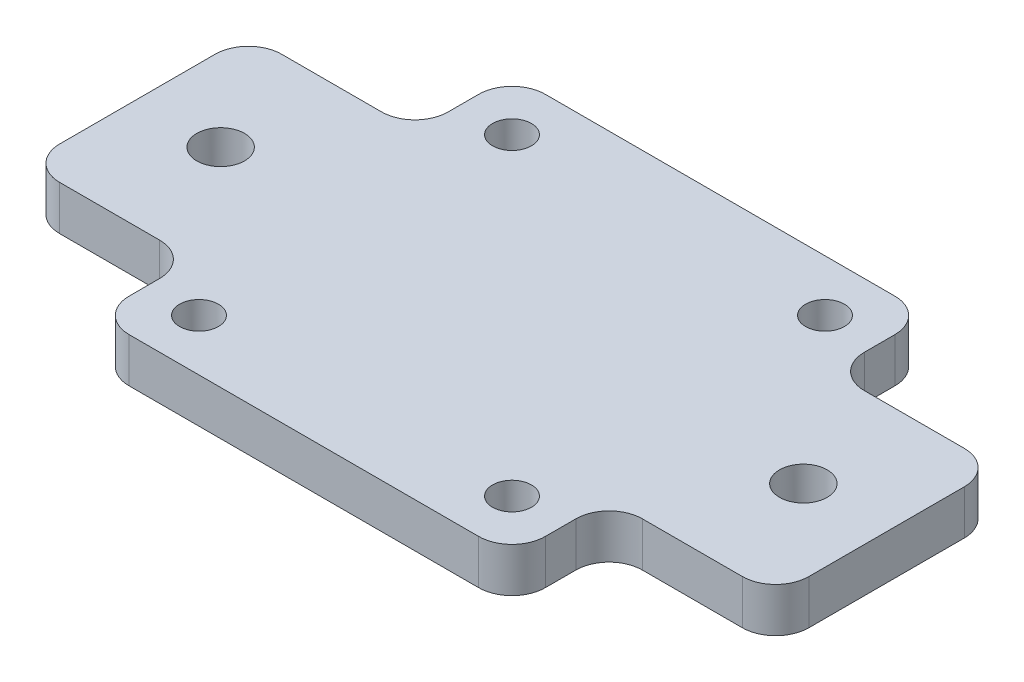
ISO-10303-21;
HEADER;
FILE_DESCRIPTION(('STEP AP214'),'2;1');
FILE_NAME('part.step','',(''),(''),'','','');
FILE_SCHEMA(('AUTOMOTIVE_DESIGN { 1 0 10303 214 1 1 1 1 }'));
ENDSEC;
DATA;
#1=APPLICATION_CONTEXT('core data for automotive mechanical design processes');
#2=APPLICATION_PROTOCOL_DEFINITION('international standard','automotive_design',2000,#1);
#3=PRODUCT_CONTEXT('',#1,'mechanical');
#4=PRODUCT('Part','Part','',(#3));
#5=PRODUCT_RELATED_PRODUCT_CATEGORY('part','',(#4));
#6=PRODUCT_DEFINITION_FORMATION('','',#4);
#7=PRODUCT_DEFINITION_CONTEXT('part definition',#1,'design');
#8=PRODUCT_DEFINITION('design','',#6,#7);
#9=PRODUCT_DEFINITION_SHAPE('','',#8);
#10=(LENGTH_UNIT() NAMED_UNIT(*) SI_UNIT(.MILLI.,.METRE.));
#11=(NAMED_UNIT(*) PLANE_ANGLE_UNIT() SI_UNIT($,.RADIAN.));
#12=(NAMED_UNIT(*) SI_UNIT($,.STERADIAN.) SOLID_ANGLE_UNIT());
#13=UNCERTAINTY_MEASURE_WITH_UNIT(LENGTH_MEASURE(1.E-05),#10,'distance_accuracy_value','');
#14=(GEOMETRIC_REPRESENTATION_CONTEXT(3) GLOBAL_UNCERTAINTY_ASSIGNED_CONTEXT((#13)) GLOBAL_UNIT_ASSIGNED_CONTEXT((#10,
#11,#12)) REPRESENTATION_CONTEXT('',''));
#15=CARTESIAN_POINT('',(0.,0.,0.));
#16=DIRECTION('',(0.,0.,1.));
#17=DIRECTION('',(1.,0.,0.));
#18=AXIS2_PLACEMENT_3D('',#15,#16,#17);
#19=CARTESIAN_POINT('',(18.75,4.,18.75));
#20=DIRECTION('',(-1.,0.,0.));
#21=DIRECTION('',(0.,0.,1.));
#22=AXIS2_PLACEMENT_3D('',#19,#20,#21);
#23=PLANE('',#22);
#24=DIRECTION('',(0.,0.,-1.));
#25=VECTOR('',#24,1.);
#26=CARTESIAN_POINT('',(18.75,0.,18.75));
#27=LINE('',#26,#25);
#28=CARTESIAN_POINT('',(18.75,0.,15.75));
#29=VERTEX_POINT('',#28);
#30=CARTESIAN_POINT('',(18.75,0.,13.));
#31=VERTEX_POINT('',#30);
#32=EDGE_CURVE('E335',#29,#31,#27,.T.);
#33=ORIENTED_EDGE('',*,*,#32,.T.);
#34=DIRECTION('',(0.,-1.,0.));
#35=VECTOR('',#34,1.);
#36=CARTESIAN_POINT('',(18.75,4.,13.));
#37=LINE('',#36,#35);
#38=CARTESIAN_POINT('',(18.75,4.,13.));
#39=VERTEX_POINT('',#38);
#40=EDGE_CURVE('E321',#31,#39,#37,.F.);
#41=ORIENTED_EDGE('',*,*,#40,.T.);
#42=DIRECTION('',(0.,0.,-1.));
#43=VECTOR('',#42,1.);
#44=CARTESIAN_POINT('',(18.75,4.,18.75));
#45=LINE('',#44,#43);
#46=CARTESIAN_POINT('',(18.75,4.,15.75));
#47=VERTEX_POINT('',#46);
#48=EDGE_CURVE('E354',#47,#39,#45,.T.);
#49=ORIENTED_EDGE('',*,*,#48,.F.);
#50=DIRECTION('',(0.,-1.,0.));
#51=VECTOR('',#50,1.);
#52=CARTESIAN_POINT('',(18.75,4.,15.75));
#53=LINE('',#52,#51);
#54=EDGE_CURVE('E263',#47,#29,#53,.T.);
#55=ORIENTED_EDGE('',*,*,#54,.T.);
#56=EDGE_LOOP('',(#33,#41,#49,#55));
#57=FACE_BOUND('',#56,.T.);
#58=ADVANCED_FACE('F35',(#57),#23,.F.);
#59=CARTESIAN_POINT('',(-18.75,4.,18.75));
#60=DIRECTION('',(1.,0.,0.));
#61=DIRECTION('',(0.,0.,-1.));
#62=AXIS2_PLACEMENT_3D('',#59,#60,#61);
#63=PLANE('',#62);
#64=DIRECTION('',(0.,0.,1.));
#65=VECTOR('',#64,1.);
#66=CARTESIAN_POINT('',(-18.75,4.,18.75));
#67=LINE('',#66,#65);
#68=CARTESIAN_POINT('',(-18.75,4.,13.));
#69=VERTEX_POINT('',#68);
#70=CARTESIAN_POINT('',(-18.75,4.,15.75));
#71=VERTEX_POINT('',#70);
#72=EDGE_CURVE('E409',#69,#71,#67,.T.);
#73=ORIENTED_EDGE('',*,*,#72,.F.);
#74=DIRECTION('',(0.,1.,0.));
#75=VECTOR('',#74,1.);
#76=CARTESIAN_POINT('',(-18.75,0.,13.));
#77=LINE('',#76,#75);
#78=CARTESIAN_POINT('',(-18.75,0.,13.));
#79=VERTEX_POINT('',#78);
#80=EDGE_CURVE('E296',#69,#79,#77,.F.);
#81=ORIENTED_EDGE('',*,*,#80,.T.);
#82=DIRECTION('',(0.,0.,1.));
#83=VECTOR('',#82,1.);
#84=CARTESIAN_POINT('',(-18.75,0.,18.75));
#85=LINE('',#84,#83);
#86=CARTESIAN_POINT('',(-18.75,0.,15.75));
#87=VERTEX_POINT('',#86);
#88=EDGE_CURVE('E229',#79,#87,#85,.T.);
#89=ORIENTED_EDGE('',*,*,#88,.T.);
#90=DIRECTION('',(0.,-1.,0.));
#91=VECTOR('',#90,1.);
#92=CARTESIAN_POINT('',(-18.75,4.,15.75));
#93=LINE('',#92,#91);
#94=EDGE_CURVE('E220',#87,#71,#93,.F.);
#95=ORIENTED_EDGE('',*,*,#94,.T.);
#96=EDGE_LOOP('',(#73,#81,#89,#95));
#97=FACE_BOUND('',#96,.T.);
#98=ADVANCED_FACE('F485',(#97),#63,.F.);
#99=CARTESIAN_POINT('',(18.75,4.,-13.));
#100=VERTEX_POINT('',#99);
#101=CARTESIAN_POINT('',(18.75,4.,-15.75));
#102=VERTEX_POINT('',#101);
#103=EDGE_CURVE('E232',#100,#102,#45,.T.);
#104=ORIENTED_EDGE('',*,*,#103,.F.);
#105=DIRECTION('',(0.,-1.,0.));
#106=VECTOR('',#105,1.);
#107=CARTESIAN_POINT('',(18.75,4.,-13.));
#108=LINE('',#107,#106);
#109=CARTESIAN_POINT('',(18.75,0.,-13.));
#110=VERTEX_POINT('',#109);
#111=EDGE_CURVE('E304',#100,#110,#108,.T.);
#112=ORIENTED_EDGE('',*,*,#111,.T.);
#113=CARTESIAN_POINT('',(18.75,0.,-15.75));
#114=VERTEX_POINT('',#113);
#115=EDGE_CURVE('E345',#110,#114,#27,.T.);
#116=ORIENTED_EDGE('',*,*,#115,.T.);
#117=DIRECTION('',(0.,-1.,0.));
#118=VECTOR('',#117,1.);
#119=CARTESIAN_POINT('',(18.75,4.,-15.75));
#120=LINE('',#119,#118);
#121=EDGE_CURVE('E266',#114,#102,#120,.F.);
#122=ORIENTED_EDGE('',*,*,#121,.T.);
#123=EDGE_LOOP('',(#104,#112,#116,#122));
#124=FACE_BOUND('',#123,.T.);
#125=ADVANCED_FACE('F469',(#124),#23,.F.);
#126=CARTESIAN_POINT('',(-18.75,4.,-18.75));
#127=DIRECTION('',(0.,0.,1.));
#128=DIRECTION('',(1.,0.,0.));
#129=AXIS2_PLACEMENT_3D('',#126,#127,#128);
#130=PLANE('',#129);
#131=DIRECTION('',(-1.,0.,0.));
#132=VECTOR('',#131,1.);
#133=CARTESIAN_POINT('',(-18.75,0.,-18.75));
#134=LINE('',#133,#132);
#135=CARTESIAN_POINT('',(15.75,0.,-18.75));
#136=VERTEX_POINT('',#135);
#137=CARTESIAN_POINT('',(-15.75,0.,-18.75));
#138=VERTEX_POINT('',#137);
#139=EDGE_CURVE('E234',#136,#138,#134,.T.);
#140=ORIENTED_EDGE('',*,*,#139,.T.);
#141=DIRECTION('',(0.,-1.,0.));
#142=VECTOR('',#141,1.);
#143=CARTESIAN_POINT('',(-15.75,4.,-18.75));
#144=LINE('',#143,#142);
#145=CARTESIAN_POINT('',(-15.75,4.,-18.75));
#146=VERTEX_POINT('',#145);
#147=EDGE_CURVE('E202',#138,#146,#144,.F.);
#148=ORIENTED_EDGE('',*,*,#147,.T.);
#149=DIRECTION('',(-1.,0.,0.));
#150=VECTOR('',#149,1.);
#151=CARTESIAN_POINT('',(-18.75,4.,-18.75));
#152=LINE('',#151,#150);
#153=CARTESIAN_POINT('',(15.75,4.,-18.75));
#154=VERTEX_POINT('',#153);
#155=EDGE_CURVE('E406',#154,#146,#152,.T.);
#156=ORIENTED_EDGE('',*,*,#155,.F.);
#157=DIRECTION('',(0.,-1.,0.));
#158=VECTOR('',#157,1.);
#159=CARTESIAN_POINT('',(15.75,4.,-18.75));
#160=LINE('',#159,#158);
#161=EDGE_CURVE('E207',#154,#136,#160,.T.);
#162=ORIENTED_EDGE('',*,*,#161,.T.);
#163=EDGE_LOOP('',(#140,#148,#156,#162));
#164=FACE_BOUND('',#163,.T.);
#165=ADVANCED_FACE('F462',(#164),#130,.F.);
#166=CARTESIAN_POINT('',(-18.75,0.,-15.75));
#167=VERTEX_POINT('',#166);
#168=CARTESIAN_POINT('',(-18.75,0.,-13.));
#169=VERTEX_POINT('',#168);
#170=EDGE_CURVE('E215',#167,#169,#85,.T.);
#171=ORIENTED_EDGE('',*,*,#170,.T.);
#172=DIRECTION('',(0.,1.,0.));
#173=VECTOR('',#172,1.);
#174=CARTESIAN_POINT('',(-18.75,4.,-13.));
#175=LINE('',#174,#173);
#176=CARTESIAN_POINT('',(-18.75,4.,-13.));
#177=VERTEX_POINT('',#176);
#178=EDGE_CURVE('E298',#169,#177,#175,.T.);
#179=ORIENTED_EDGE('',*,*,#178,.T.);
#180=CARTESIAN_POINT('',(-18.75,4.,-15.75));
#181=VERTEX_POINT('',#180);
#182=EDGE_CURVE('E218',#181,#177,#67,.T.);
#183=ORIENTED_EDGE('',*,*,#182,.F.);
#184=DIRECTION('',(0.,-1.,0.));
#185=VECTOR('',#184,1.);
#186=CARTESIAN_POINT('',(-18.75,4.,-15.75));
#187=LINE('',#186,#185);
#188=EDGE_CURVE('E201',#181,#167,#187,.T.);
#189=ORIENTED_EDGE('',*,*,#188,.T.);
#190=EDGE_LOOP('',(#171,#179,#183,#189));
#191=FACE_BOUND('',#190,.T.);
#192=ADVANCED_FACE('F213',(#191),#63,.F.);
#193=CARTESIAN_POINT('',(-18.75,4.,18.75));
#194=DIRECTION('',(0.,0.,-1.));
#195=DIRECTION('',(-1.,0.,0.));
#196=AXIS2_PLACEMENT_3D('',#193,#194,#195);
#197=PLANE('',#196);
#198=DIRECTION('',(1.,0.,0.));
#199=VECTOR('',#198,1.);
#200=CARTESIAN_POINT('',(-18.75,4.,18.75));
#201=LINE('',#200,#199);
#202=CARTESIAN_POINT('',(-15.75,4.,18.75));
#203=VERTEX_POINT('',#202);
#204=CARTESIAN_POINT('',(15.75,4.,18.75));
#205=VERTEX_POINT('',#204);
#206=EDGE_CURVE('E239',#203,#205,#201,.T.);
#207=ORIENTED_EDGE('',*,*,#206,.F.);
#208=DIRECTION('',(0.,-1.,0.));
#209=VECTOR('',#208,1.);
#210=CARTESIAN_POINT('',(-15.75,4.,18.75));
#211=LINE('',#210,#209);
#212=CARTESIAN_POINT('',(-15.75,0.,18.75));
#213=VERTEX_POINT('',#212);
#214=EDGE_CURVE('E260',#203,#213,#211,.T.);
#215=ORIENTED_EDGE('',*,*,#214,.T.);
#216=DIRECTION('',(1.,0.,0.));
#217=VECTOR('',#216,1.);
#218=CARTESIAN_POINT('',(-18.75,0.,18.75));
#219=LINE('',#218,#217);
#220=CARTESIAN_POINT('',(15.75,0.,18.75));
#221=VERTEX_POINT('',#220);
#222=EDGE_CURVE('E228',#213,#221,#219,.T.);
#223=ORIENTED_EDGE('',*,*,#222,.T.);
#224=DIRECTION('',(0.,-1.,0.));
#225=VECTOR('',#224,1.);
#226=CARTESIAN_POINT('',(15.75,4.,18.75));
#227=LINE('',#226,#225);
#228=EDGE_CURVE('E258',#221,#205,#227,.F.);
#229=ORIENTED_EDGE('',*,*,#228,.T.);
#230=EDGE_LOOP('',(#207,#215,#223,#229));
#231=FACE_BOUND('',#230,.T.);
#232=ADVANCED_FACE('F421',(#231),#197,.F.);
#233=CARTESIAN_POINT('',(0.,4.,0.));
#234=DIRECTION('',(0.,-1.,0.));
#235=DIRECTION('',(0.,0.,-1.));
#236=AXIS2_PLACEMENT_3D('',#233,#234,#235);
#237=PLANE('',#236);
#238=CARTESIAN_POINT('',(-26.25,4.,0.));
#239=DIRECTION('',(0.,-1.,0.));
#240=DIRECTION('',(0.,0.,-1.));
#241=AXIS2_PLACEMENT_3D('',#238,#239,#240);
#242=CIRCLE('',#241,2.15);
#243=CARTESIAN_POINT('',(-26.25,4.,-2.15));
#244=VERTEX_POINT('',#243);
#245=EDGE_CURVE('E371',#244,#244,#242,.T.);
#246=ORIENTED_EDGE('',*,*,#245,.T.);
#247=EDGE_LOOP('',(#246));
#248=FACE_BOUND('',#247,.T.);
#249=CARTESIAN_POINT('',(26.25,4.,0.));
#250=DIRECTION('',(0.,-1.,0.));
#251=DIRECTION('',(0.,0.,-1.));
#252=AXIS2_PLACEMENT_3D('',#249,#250,#251);
#253=CIRCLE('',#252,2.15);
#254=CARTESIAN_POINT('',(26.25,4.,-2.15000000000001));
#255=VERTEX_POINT('',#254);
#256=EDGE_CURVE('E552',#255,#255,#253,.T.);
#257=ORIENTED_EDGE('',*,*,#256,.T.);
#258=EDGE_LOOP('',(#257));
#259=FACE_BOUND('',#258,.T.);
#260=CARTESIAN_POINT('',(14.1,4.,-14.1));
#261=DIRECTION('',(0.,-1.,0.));
#262=DIRECTION('',(0.,0.,-1.));
#263=AXIS2_PLACEMENT_3D('',#260,#261,#262);
#264=CIRCLE('',#263,1.75);
#265=CARTESIAN_POINT('',(14.1,4.,-15.85));
#266=VERTEX_POINT('',#265);
#267=EDGE_CURVE('E396',#266,#266,#264,.T.);
#268=ORIENTED_EDGE('',*,*,#267,.T.);
#269=EDGE_LOOP('',(#268));
#270=FACE_BOUND('',#269,.T.);
#271=CARTESIAN_POINT('',(-14.1,4.,-14.1));
#272=DIRECTION('',(0.,-1.,0.));
#273=DIRECTION('',(0.,0.,-1.));
#274=AXIS2_PLACEMENT_3D('',#271,#272,#273);
#275=CIRCLE('',#274,1.75);
#276=CARTESIAN_POINT('',(-14.1,4.,-15.85));
#277=VERTEX_POINT('',#276);
#278=EDGE_CURVE('E393',#277,#277,#275,.T.);
#279=ORIENTED_EDGE('',*,*,#278,.T.);
#280=EDGE_LOOP('',(#279));
#281=FACE_BOUND('',#280,.T.);
#282=DIRECTION('',(0.,0.,-1.));
#283=VECTOR('',#282,1.);
#284=CARTESIAN_POINT('',(-33.75,4.,-10.));
#285=LINE('',#284,#283);
#286=CARTESIAN_POINT('',(-33.75,4.,7.));
#287=VERTEX_POINT('',#286);
#288=CARTESIAN_POINT('',(-33.75,4.,-7.));
#289=VERTEX_POINT('',#288);
#290=EDGE_CURVE('E381',#287,#289,#285,.T.);
#291=ORIENTED_EDGE('',*,*,#290,.F.);
#292=CARTESIAN_POINT('',(-30.75,4.,7.));
#293=DIRECTION('',(0.,-1.,0.));
#294=DIRECTION('',(0.,0.,-1.));
#295=AXIS2_PLACEMENT_3D('',#292,#293,#294);
#296=CIRCLE('',#295,3.);
#297=CARTESIAN_POINT('',(-30.75,4.,10.));
#298=VERTEX_POINT('',#297);
#299=EDGE_CURVE('E294',#287,#298,#296,.F.);
#300=ORIENTED_EDGE('',*,*,#299,.T.);
#301=DIRECTION('',(-1.,0.,0.));
#302=VECTOR('',#301,1.);
#303=CARTESIAN_POINT('',(-33.75,4.,10.));
#304=LINE('',#303,#302);
#305=CARTESIAN_POINT('',(-21.75,4.,10.));
#306=VERTEX_POINT('',#305);
#307=EDGE_CURVE('E359',#306,#298,#304,.T.);
#308=ORIENTED_EDGE('',*,*,#307,.F.);
#309=CARTESIAN_POINT('',(-21.75,4.,13.));
#310=DIRECTION('',(0.,-1.,0.));
#311=DIRECTION('',(0.,0.,-1.));
#312=AXIS2_PLACEMENT_3D('',#309,#310,#311);
#313=CIRCLE('',#312,3.);
#314=EDGE_CURVE('E323',#306,#69,#313,.T.);
#315=ORIENTED_EDGE('',*,*,#314,.T.);
#316=ORIENTED_EDGE('',*,*,#72,.T.);
#317=CARTESIAN_POINT('',(-15.75,4.,15.75));
#318=DIRECTION('',(0.,-1.,0.));
#319=DIRECTION('',(0.,0.,-1.));
#320=AXIS2_PLACEMENT_3D('',#317,#318,#319);
#321=CIRCLE('',#320,3.);
#322=EDGE_CURVE('E254',#71,#203,#321,.F.);
#323=ORIENTED_EDGE('',*,*,#322,.T.);
#324=ORIENTED_EDGE('',*,*,#206,.T.);
#325=CARTESIAN_POINT('',(15.75,4.,15.75));
#326=DIRECTION('',(0.,-1.,0.));
#327=DIRECTION('',(0.,0.,-1.));
#328=AXIS2_PLACEMENT_3D('',#325,#326,#327);
#329=CIRCLE('',#328,3.);
#330=EDGE_CURVE('E250',#205,#47,#329,.F.);
#331=ORIENTED_EDGE('',*,*,#330,.T.);
#332=ORIENTED_EDGE('',*,*,#48,.T.);
#333=CARTESIAN_POINT('',(21.75,4.,13.));
#334=DIRECTION('',(0.,-1.,0.));
#335=DIRECTION('',(0.,0.,-1.));
#336=AXIS2_PLACEMENT_3D('',#333,#334,#335);
#337=CIRCLE('',#336,3.);
#338=CARTESIAN_POINT('',(21.75,4.,10.));
#339=VERTEX_POINT('',#338);
#340=EDGE_CURVE('E11',#39,#339,#337,.T.);
#341=ORIENTED_EDGE('',*,*,#340,.T.);
#342=CARTESIAN_POINT('',(30.75,4.,10.));
#343=VERTEX_POINT('',#342);
#344=EDGE_CURVE('E352',#343,#339,#304,.T.);
#345=ORIENTED_EDGE('',*,*,#344,.F.);
#346=CARTESIAN_POINT('',(30.75,4.,7.));
#347=DIRECTION('',(0.,-1.,0.));
#348=DIRECTION('',(0.,0.,-1.));
#349=AXIS2_PLACEMENT_3D('',#346,#347,#348);
#350=CIRCLE('',#349,3.);
#351=CARTESIAN_POINT('',(33.75,4.,7.));
#352=VERTEX_POINT('',#351);
#353=EDGE_CURVE('E288',#343,#352,#350,.F.);
#354=ORIENTED_EDGE('',*,*,#353,.T.);
#355=DIRECTION('',(0.,0.,-1.));
#356=VECTOR('',#355,1.);
#357=CARTESIAN_POINT('',(33.75,4.,-10.));
#358=LINE('',#357,#356);
#359=CARTESIAN_POINT('',(33.75,4.,-7.));
#360=VERTEX_POINT('',#359);
#361=EDGE_CURVE('E365',#352,#360,#358,.T.);
#362=ORIENTED_EDGE('',*,*,#361,.T.);
#363=CARTESIAN_POINT('',(30.75,4.,-7.));
#364=DIRECTION('',(0.,-1.,0.));
#365=DIRECTION('',(0.,0.,-1.));
#366=AXIS2_PLACEMENT_3D('',#363,#364,#365);
#367=CIRCLE('',#366,3.);
#368=CARTESIAN_POINT('',(30.75,4.,-10.));
#369=VERTEX_POINT('',#368);
#370=EDGE_CURVE('E290',#360,#369,#367,.F.);
#371=ORIENTED_EDGE('',*,*,#370,.T.);
#372=DIRECTION('',(-1.,0.,0.));
#373=VECTOR('',#372,1.);
#374=CARTESIAN_POINT('',(-33.75,4.,-10.));
#375=LINE('',#374,#373);
#376=CARTESIAN_POINT('',(21.75,4.,-10.));
#377=VERTEX_POINT('',#376);
#378=EDGE_CURVE('E557',#369,#377,#375,.T.);
#379=ORIENTED_EDGE('',*,*,#378,.T.);
#380=CARTESIAN_POINT('',(21.75,4.,-13.));
#381=DIRECTION('',(0.,-1.,0.));
#382=DIRECTION('',(0.,0.,-1.));
#383=AXIS2_PLACEMENT_3D('',#380,#381,#382);
#384=CIRCLE('',#383,3.);
#385=EDGE_CURVE('E50',#377,#100,#384,.T.);
#386=ORIENTED_EDGE('',*,*,#385,.T.);
#387=ORIENTED_EDGE('',*,*,#103,.T.);
#388=CARTESIAN_POINT('',(15.75,4.,-15.75));
#389=DIRECTION('',(0.,-1.,0.));
#390=DIRECTION('',(0.,0.,-1.));
#391=AXIS2_PLACEMENT_3D('',#388,#389,#390);
#392=CIRCLE('',#391,3.);
#393=EDGE_CURVE('E252',#102,#154,#392,.F.);
#394=ORIENTED_EDGE('',*,*,#393,.T.);
#395=ORIENTED_EDGE('',*,*,#155,.T.);
#396=CARTESIAN_POINT('',(-15.75,4.,-15.75));
#397=DIRECTION('',(0.,-1.,0.));
#398=DIRECTION('',(0.,0.,-1.));
#399=AXIS2_PLACEMENT_3D('',#396,#397,#398);
#400=CIRCLE('',#399,3.);
#401=EDGE_CURVE('E256',#146,#181,#400,.F.);
#402=ORIENTED_EDGE('',*,*,#401,.T.);
#403=ORIENTED_EDGE('',*,*,#182,.T.);
#404=CARTESIAN_POINT('',(-21.75,4.,-13.));
#405=DIRECTION('',(0.,-1.,0.));
#406=DIRECTION('',(0.,0.,-1.));
#407=AXIS2_PLACEMENT_3D('',#404,#405,#406);
#408=CIRCLE('',#407,3.);
#409=CARTESIAN_POINT('',(-21.75,4.,-10.));
#410=VERTEX_POINT('',#409);
#411=EDGE_CURVE('E327',#177,#410,#408,.T.);
#412=ORIENTED_EDGE('',*,*,#411,.T.);
#413=CARTESIAN_POINT('',(-30.75,4.,-10.));
#414=VERTEX_POINT('',#413);
#415=EDGE_CURVE('E384',#410,#414,#375,.T.);
#416=ORIENTED_EDGE('',*,*,#415,.T.);
#417=CARTESIAN_POINT('',(-30.75,4.,-7.));
#418=DIRECTION('',(0.,-1.,0.));
#419=DIRECTION('',(0.,0.,-1.));
#420=AXIS2_PLACEMENT_3D('',#417,#418,#419);
#421=CIRCLE('',#420,3.);
#422=EDGE_CURVE('E292',#414,#289,#421,.F.);
#423=ORIENTED_EDGE('',*,*,#422,.T.);
#424=EDGE_LOOP('',(#291,#300,#308,#315,#316,#323,#324,#331,#332,#341,#345,#354,#362,#371,#379,
#386,#387,#394,#395,#402,#403,#412,#416,#423));
#425=FACE_BOUND('',#424,.T.);
#426=CARTESIAN_POINT('',(14.1,4.,14.1));
#427=DIRECTION('',(0.,-1.,0.));
#428=DIRECTION('',(0.,0.,-1.));
#429=AXIS2_PLACEMENT_3D('',#426,#427,#428);
#430=CIRCLE('',#429,1.75);
#431=CARTESIAN_POINT('',(14.1,4.,12.35));
#432=VERTEX_POINT('',#431);
#433=EDGE_CURVE('E399',#432,#432,#430,.T.);
#434=ORIENTED_EDGE('',*,*,#433,.T.);
#435=EDGE_LOOP('',(#434));
#436=FACE_BOUND('',#435,.T.);
#437=CARTESIAN_POINT('',(-14.1,4.,14.1));
#438=DIRECTION('',(0.,-1.,0.));
#439=DIRECTION('',(0.,0.,-1.));
#440=AXIS2_PLACEMENT_3D('',#437,#438,#439);
#441=CIRCLE('',#440,1.75);
#442=CARTESIAN_POINT('',(-14.1,4.,12.35));
#443=VERTEX_POINT('',#442);
#444=EDGE_CURVE('E402',#443,#443,#441,.T.);
#445=ORIENTED_EDGE('',*,*,#444,.T.);
#446=EDGE_LOOP('',(#445));
#447=FACE_BOUND('',#446,.T.);
#448=ADVANCED_FACE('F350',(#248,#259,#270,#281,#425,#436,#447),#237,.F.);
#449=CARTESIAN_POINT('',(0.,0.,0.));
#450=DIRECTION('',(0.,-1.,0.));
#451=DIRECTION('',(0.,0.,-1.));
#452=AXIS2_PLACEMENT_3D('',#449,#450,#451);
#453=PLANE('',#452);
#454=CARTESIAN_POINT('',(-26.25,0.,0.));
#455=DIRECTION('',(0.,1.,0.));
#456=DIRECTION('',(0.,0.,1.));
#457=AXIS2_PLACEMENT_3D('',#454,#455,#456);
#458=CIRCLE('',#457,2.15);
#459=CARTESIAN_POINT('',(-26.25,0.,2.15));
#460=VERTEX_POINT('',#459);
#461=EDGE_CURVE('E549',#460,#460,#458,.T.);
#462=ORIENTED_EDGE('',*,*,#461,.T.);
#463=EDGE_LOOP('',(#462));
#464=FACE_BOUND('',#463,.T.);
#465=CARTESIAN_POINT('',(26.25,0.,0.));
#466=DIRECTION('',(0.,1.,0.));
#467=DIRECTION('',(0.,0.,1.));
#468=AXIS2_PLACEMENT_3D('',#465,#466,#467);
#469=CIRCLE('',#468,2.15);
#470=CARTESIAN_POINT('',(26.25,0.,2.14999999999999));
#471=VERTEX_POINT('',#470);
#472=EDGE_CURVE('E770',#471,#471,#469,.T.);
#473=ORIENTED_EDGE('',*,*,#472,.T.);
#474=EDGE_LOOP('',(#473));
#475=FACE_BOUND('',#474,.T.);
#476=DIRECTION('',(1.,0.,0.));
#477=VECTOR('',#476,1.);
#478=CARTESIAN_POINT('',(-33.75,0.,10.));
#479=LINE('',#478,#477);
#480=CARTESIAN_POINT('',(-30.75,0.,10.));
#481=VERTEX_POINT('',#480);
#482=CARTESIAN_POINT('',(-21.75,0.,10.));
#483=VERTEX_POINT('',#482);
#484=EDGE_CURVE('E370',#481,#483,#479,.T.);
#485=ORIENTED_EDGE('',*,*,#484,.F.);
#486=CARTESIAN_POINT('',(-30.75,0.,7.));
#487=DIRECTION('',(0.,-1.,0.));
#488=DIRECTION('',(0.,0.,-1.));
#489=AXIS2_PLACEMENT_3D('',#486,#487,#488);
#490=CIRCLE('',#489,3.);
#491=CARTESIAN_POINT('',(-33.75,0.,7.));
#492=VERTEX_POINT('',#491);
#493=EDGE_CURVE('E281',#481,#492,#490,.T.);
#494=ORIENTED_EDGE('',*,*,#493,.T.);
#495=DIRECTION('',(0.,0.,1.));
#496=VECTOR('',#495,1.);
#497=CARTESIAN_POINT('',(-33.75,0.,-10.));
#498=LINE('',#497,#496);
#499=CARTESIAN_POINT('',(-33.75,0.,-7.));
#500=VERTEX_POINT('',#499);
#501=EDGE_CURVE('E378',#500,#492,#498,.T.);
#502=ORIENTED_EDGE('',*,*,#501,.F.);
#503=CARTESIAN_POINT('',(-30.75,0.,-7.));
#504=DIRECTION('',(0.,-1.,0.));
#505=DIRECTION('',(0.,0.,-1.));
#506=AXIS2_PLACEMENT_3D('',#503,#504,#505);
#507=CIRCLE('',#506,3.);
#508=CARTESIAN_POINT('',(-30.75,0.,-10.));
#509=VERTEX_POINT('',#508);
#510=EDGE_CURVE('E279',#500,#509,#507,.T.);
#511=ORIENTED_EDGE('',*,*,#510,.T.);
#512=DIRECTION('',(1.,0.,0.));
#513=VECTOR('',#512,1.);
#514=CARTESIAN_POINT('',(-33.75,0.,-10.));
#515=LINE('',#514,#513);
#516=CARTESIAN_POINT('',(-21.75,0.,-10.));
#517=VERTEX_POINT('',#516);
#518=EDGE_CURVE('E376',#509,#517,#515,.T.);
#519=ORIENTED_EDGE('',*,*,#518,.T.);
#520=CARTESIAN_POINT('',(-21.75,0.,-13.));
#521=DIRECTION('',(0.,-1.,0.));
#522=DIRECTION('',(0.,0.,-1.));
#523=AXIS2_PLACEMENT_3D('',#520,#521,#522);
#524=CIRCLE('',#523,3.);
#525=EDGE_CURVE('E227',#517,#169,#524,.F.);
#526=ORIENTED_EDGE('',*,*,#525,.T.);
#527=ORIENTED_EDGE('',*,*,#170,.F.);
#528=CARTESIAN_POINT('',(-15.75,0.,-15.75));
#529=DIRECTION('',(0.,-1.,0.));
#530=DIRECTION('',(0.,0.,-1.));
#531=AXIS2_PLACEMENT_3D('',#528,#529,#530);
#532=CIRCLE('',#531,3.);
#533=EDGE_CURVE('E197',#167,#138,#532,.T.);
#534=ORIENTED_EDGE('',*,*,#533,.T.);
#535=ORIENTED_EDGE('',*,*,#139,.F.);
#536=CARTESIAN_POINT('',(15.75,0.,-15.75));
#537=DIRECTION('',(0.,-1.,0.));
#538=DIRECTION('',(0.,0.,-1.));
#539=AXIS2_PLACEMENT_3D('',#536,#537,#538);
#540=CIRCLE('',#539,3.);
#541=EDGE_CURVE('E242',#136,#114,#540,.T.);
#542=ORIENTED_EDGE('',*,*,#541,.T.);
#543=ORIENTED_EDGE('',*,*,#115,.F.);
#544=CARTESIAN_POINT('',(21.75,0.,-13.));
#545=DIRECTION('',(0.,-1.,0.));
#546=DIRECTION('',(0.,0.,-1.));
#547=AXIS2_PLACEMENT_3D('',#544,#545,#546);
#548=CIRCLE('',#547,3.);
#549=CARTESIAN_POINT('',(21.75,0.,-10.));
#550=VERTEX_POINT('',#549);
#551=EDGE_CURVE('E330',#110,#550,#548,.F.);
#552=ORIENTED_EDGE('',*,*,#551,.T.);
#553=CARTESIAN_POINT('',(30.75,0.,-10.));
#554=VERTEX_POINT('',#553);
#555=EDGE_CURVE('E375',#550,#554,#515,.T.);
#556=ORIENTED_EDGE('',*,*,#555,.T.);
#557=CARTESIAN_POINT('',(30.75,0.,-7.));
#558=DIRECTION('',(0.,-1.,0.));
#559=DIRECTION('',(0.,0.,-1.));
#560=AXIS2_PLACEMENT_3D('',#557,#558,#559);
#561=CIRCLE('',#560,3.);
#562=CARTESIAN_POINT('',(33.75,0.,-7.));
#563=VERTEX_POINT('',#562);
#564=EDGE_CURVE('E277',#554,#563,#561,.T.);
#565=ORIENTED_EDGE('',*,*,#564,.T.);
#566=DIRECTION('',(0.,0.,1.));
#567=VECTOR('',#566,1.);
#568=CARTESIAN_POINT('',(33.75,0.,-10.));
#569=LINE('',#568,#567);
#570=CARTESIAN_POINT('',(33.75,0.,7.));
#571=VERTEX_POINT('',#570);
#572=EDGE_CURVE('E372',#563,#571,#569,.T.);
#573=ORIENTED_EDGE('',*,*,#572,.T.);
#574=CARTESIAN_POINT('',(30.75,0.,7.));
#575=DIRECTION('',(0.,-1.,0.));
#576=DIRECTION('',(0.,0.,-1.));
#577=AXIS2_PLACEMENT_3D('',#574,#575,#576);
#578=CIRCLE('',#577,3.);
#579=CARTESIAN_POINT('',(30.75,0.,10.));
#580=VERTEX_POINT('',#579);
#581=EDGE_CURVE('E275',#571,#580,#578,.T.);
#582=ORIENTED_EDGE('',*,*,#581,.T.);
#583=CARTESIAN_POINT('',(21.75,0.,10.));
#584=VERTEX_POINT('',#583);
#585=EDGE_CURVE('E337',#584,#580,#479,.T.);
#586=ORIENTED_EDGE('',*,*,#585,.F.);
#587=CARTESIAN_POINT('',(21.75,0.,13.));
#588=DIRECTION('',(0.,-1.,0.));
#589=DIRECTION('',(0.,0.,-1.));
#590=AXIS2_PLACEMENT_3D('',#587,#588,#589);
#591=CIRCLE('',#590,3.);
#592=EDGE_CURVE('E43',#584,#31,#591,.F.);
#593=ORIENTED_EDGE('',*,*,#592,.T.);
#594=ORIENTED_EDGE('',*,*,#32,.F.);
#595=CARTESIAN_POINT('',(15.75,0.,15.75));
#596=DIRECTION('',(0.,-1.,0.));
#597=DIRECTION('',(0.,0.,-1.));
#598=AXIS2_PLACEMENT_3D('',#595,#596,#597);
#599=CIRCLE('',#598,3.);
#600=EDGE_CURVE('E219',#29,#221,#599,.T.);
#601=ORIENTED_EDGE('',*,*,#600,.T.);
#602=ORIENTED_EDGE('',*,*,#222,.F.);
#603=CARTESIAN_POINT('',(-15.75,0.,15.75));
#604=DIRECTION('',(0.,-1.,0.));
#605=DIRECTION('',(0.,0.,-1.));
#606=AXIS2_PLACEMENT_3D('',#603,#604,#605);
#607=CIRCLE('',#606,3.);
#608=EDGE_CURVE('E208',#213,#87,#607,.T.);
#609=ORIENTED_EDGE('',*,*,#608,.T.);
#610=ORIENTED_EDGE('',*,*,#88,.F.);
#611=CARTESIAN_POINT('',(-21.75,0.,13.));
#612=DIRECTION('',(0.,-1.,0.));
#613=DIRECTION('',(0.,0.,-1.));
#614=AXIS2_PLACEMENT_3D('',#611,#612,#613);
#615=CIRCLE('',#614,3.);
#616=EDGE_CURVE('E325',#79,#483,#615,.F.);
#617=ORIENTED_EDGE('',*,*,#616,.T.);
#618=EDGE_LOOP('',(#485,#494,#502,#511,#519,#526,#527,#534,#535,#542,#543,#552,#556,#565,#573,
#582,#586,#593,#594,#601,#602,#609,#610,#617));
#619=FACE_BOUND('',#618,.T.);
#620=CARTESIAN_POINT('',(14.1,0.,-14.1));
#621=DIRECTION('',(0.,1.,0.));
#622=DIRECTION('',(0.,0.,1.));
#623=AXIS2_PLACEMENT_3D('',#620,#621,#622);
#624=CIRCLE('',#623,1.75);
#625=CARTESIAN_POINT('',(14.1,0.,-12.35));
#626=VERTEX_POINT('',#625);
#627=EDGE_CURVE('E385',#626,#626,#624,.T.);
#628=ORIENTED_EDGE('',*,*,#627,.T.);
#629=EDGE_LOOP('',(#628));
#630=FACE_BOUND('',#629,.T.);
#631=CARTESIAN_POINT('',(-14.1,0.,-14.1));
#632=DIRECTION('',(0.,1.,0.));
#633=DIRECTION('',(0.,0.,1.));
#634=AXIS2_PLACEMENT_3D('',#631,#632,#633);
#635=CIRCLE('',#634,1.75);
#636=CARTESIAN_POINT('',(-14.1,0.,-12.35));
#637=VERTEX_POINT('',#636);
#638=EDGE_CURVE('E388',#637,#637,#635,.T.);
#639=ORIENTED_EDGE('',*,*,#638,.T.);
#640=EDGE_LOOP('',(#639));
#641=FACE_BOUND('',#640,.T.);
#642=CARTESIAN_POINT('',(14.1,0.,14.1));
#643=DIRECTION('',(0.,1.,0.));
#644=DIRECTION('',(0.,0.,1.));
#645=AXIS2_PLACEMENT_3D('',#642,#643,#644);
#646=CIRCLE('',#645,1.75);
#647=CARTESIAN_POINT('',(14.1,0.,15.85));
#648=VERTEX_POINT('',#647);
#649=EDGE_CURVE('E362',#648,#648,#646,.T.);
#650=ORIENTED_EDGE('',*,*,#649,.T.);
#651=EDGE_LOOP('',(#650));
#652=FACE_BOUND('',#651,.T.);
#653=CARTESIAN_POINT('',(-14.1,0.,14.1));
#654=DIRECTION('',(0.,1.,0.));
#655=DIRECTION('',(0.,0.,1.));
#656=AXIS2_PLACEMENT_3D('',#653,#654,#655);
#657=CIRCLE('',#656,1.75);
#658=CARTESIAN_POINT('',(-14.1,0.,15.85));
#659=VERTEX_POINT('',#658);
#660=EDGE_CURVE('E358',#659,#659,#657,.T.);
#661=ORIENTED_EDGE('',*,*,#660,.T.);
#662=EDGE_LOOP('',(#661));
#663=FACE_BOUND('',#662,.T.);
#664=ADVANCED_FACE('F223',(#464,#475,#619,#630,#641,#652,#663),#453,.T.);
#665=CARTESIAN_POINT('',(-15.75,4.,-15.75));
#666=DIRECTION('',(0.,-1.,0.));
#667=DIRECTION('',(0.,0.,-1.));
#668=AXIS2_PLACEMENT_3D('',#665,#666,#667);
#669=CYLINDRICAL_SURFACE('',#668,3.);
#670=ORIENTED_EDGE('',*,*,#401,.F.);
#671=ORIENTED_EDGE('',*,*,#147,.F.);
#672=ORIENTED_EDGE('',*,*,#533,.F.);
#673=ORIENTED_EDGE('',*,*,#188,.F.);
#674=EDGE_LOOP('',(#670,#671,#672,#673));
#675=FACE_BOUND('',#674,.T.);
#676=ADVANCED_FACE('F200',(#675),#669,.T.);
#677=CARTESIAN_POINT('',(-15.75,4.,15.75));
#678=DIRECTION('',(0.,-1.,0.));
#679=DIRECTION('',(0.,0.,-1.));
#680=AXIS2_PLACEMENT_3D('',#677,#678,#679);
#681=CYLINDRICAL_SURFACE('',#680,3.);
#682=ORIENTED_EDGE('',*,*,#322,.F.);
#683=ORIENTED_EDGE('',*,*,#94,.F.);
#684=ORIENTED_EDGE('',*,*,#608,.F.);
#685=ORIENTED_EDGE('',*,*,#214,.F.);
#686=EDGE_LOOP('',(#682,#683,#684,#685));
#687=FACE_BOUND('',#686,.T.);
#688=ADVANCED_FACE('F423',(#687),#681,.T.);
#689=CARTESIAN_POINT('',(15.75,4.,-15.75));
#690=DIRECTION('',(0.,-1.,0.));
#691=DIRECTION('',(0.,0.,-1.));
#692=AXIS2_PLACEMENT_3D('',#689,#690,#691);
#693=CYLINDRICAL_SURFACE('',#692,3.);
#694=ORIENTED_EDGE('',*,*,#393,.F.);
#695=ORIENTED_EDGE('',*,*,#121,.F.);
#696=ORIENTED_EDGE('',*,*,#541,.F.);
#697=ORIENTED_EDGE('',*,*,#161,.F.);
#698=EDGE_LOOP('',(#694,#695,#696,#697));
#699=FACE_BOUND('',#698,.T.);
#700=ADVANCED_FACE('F464',(#699),#693,.T.);
#701=CARTESIAN_POINT('',(15.75,4.,15.75));
#702=DIRECTION('',(0.,-1.,0.));
#703=DIRECTION('',(0.,0.,-1.));
#704=AXIS2_PLACEMENT_3D('',#701,#702,#703);
#705=CYLINDRICAL_SURFACE('',#704,3.);
#706=ORIENTED_EDGE('',*,*,#330,.F.);
#707=ORIENTED_EDGE('',*,*,#228,.F.);
#708=ORIENTED_EDGE('',*,*,#600,.F.);
#709=ORIENTED_EDGE('',*,*,#54,.F.);
#710=EDGE_LOOP('',(#706,#707,#708,#709));
#711=FACE_BOUND('',#710,.T.);
#712=ADVANCED_FACE('F419',(#711),#705,.T.);
#713=CARTESIAN_POINT('',(-14.1,0.,-14.1));
#714=DIRECTION('',(0.,1.,0.));
#715=DIRECTION('',(0.,0.,1.));
#716=AXIS2_PLACEMENT_3D('',#713,#714,#715);
#717=CYLINDRICAL_SURFACE('',#716,1.75);
#718=ORIENTED_EDGE('',*,*,#638,.F.);
#719=EDGE_LOOP('',(#718));
#720=FACE_BOUND('',#719,.T.);
#721=ORIENTED_EDGE('',*,*,#278,.F.);
#722=EDGE_LOOP('',(#721));
#723=FACE_BOUND('',#722,.T.);
#724=ADVANCED_FACE('F510',(#720,#723),#717,.F.);
#725=CARTESIAN_POINT('',(14.1,0.,-14.1));
#726=DIRECTION('',(0.,1.,0.));
#727=DIRECTION('',(0.,0.,1.));
#728=AXIS2_PLACEMENT_3D('',#725,#726,#727);
#729=CYLINDRICAL_SURFACE('',#728,1.75);
#730=ORIENTED_EDGE('',*,*,#627,.F.);
#731=EDGE_LOOP('',(#730));
#732=FACE_BOUND('',#731,.T.);
#733=ORIENTED_EDGE('',*,*,#267,.F.);
#734=EDGE_LOOP('',(#733));
#735=FACE_BOUND('',#734,.T.);
#736=ADVANCED_FACE('F513',(#732,#735),#729,.F.);
#737=CARTESIAN_POINT('',(14.1,0.,14.1));
#738=DIRECTION('',(0.,1.,0.));
#739=DIRECTION('',(0.,0.,1.));
#740=AXIS2_PLACEMENT_3D('',#737,#738,#739);
#741=CYLINDRICAL_SURFACE('',#740,1.75);
#742=ORIENTED_EDGE('',*,*,#649,.F.);
#743=EDGE_LOOP('',(#742));
#744=FACE_BOUND('',#743,.T.);
#745=ORIENTED_EDGE('',*,*,#433,.F.);
#746=EDGE_LOOP('',(#745));
#747=FACE_BOUND('',#746,.T.);
#748=ADVANCED_FACE('F518',(#744,#747),#741,.F.);
#749=CARTESIAN_POINT('',(-14.1,0.,14.1));
#750=DIRECTION('',(0.,1.,0.));
#751=DIRECTION('',(0.,0.,1.));
#752=AXIS2_PLACEMENT_3D('',#749,#750,#751);
#753=CYLINDRICAL_SURFACE('',#752,1.75);
#754=ORIENTED_EDGE('',*,*,#660,.F.);
#755=EDGE_LOOP('',(#754));
#756=FACE_BOUND('',#755,.T.);
#757=ORIENTED_EDGE('',*,*,#444,.F.);
#758=EDGE_LOOP('',(#757));
#759=FACE_BOUND('',#758,.T.);
#760=ADVANCED_FACE('F515',(#756,#759),#753,.F.);
#761=CARTESIAN_POINT('',(-33.75,74.4006392016436,-10.));
#762=DIRECTION('',(1.,0.,0.));
#763=DIRECTION('',(0.,0.,-1.));
#764=AXIS2_PLACEMENT_3D('',#761,#762,#763);
#765=PLANE('',#764);
#766=ORIENTED_EDGE('',*,*,#501,.T.);
#767=DIRECTION('',(0.,-1.,0.));
#768=VECTOR('',#767,1.);
#769=CARTESIAN_POINT('',(-33.75,74.4006392016436,7.));
#770=LINE('',#769,#768);
#771=EDGE_CURVE('E286',#492,#287,#770,.F.);
#772=ORIENTED_EDGE('',*,*,#771,.T.);
#773=ORIENTED_EDGE('',*,*,#290,.T.);
#774=DIRECTION('',(0.,-1.,0.));
#775=VECTOR('',#774,1.);
#776=CARTESIAN_POINT('',(-33.75,0.,-7.));
#777=LINE('',#776,#775);
#778=EDGE_CURVE('E283',#289,#500,#777,.T.);
#779=ORIENTED_EDGE('',*,*,#778,.T.);
#780=EDGE_LOOP('',(#766,#772,#773,#779));
#781=FACE_BOUND('',#780,.T.);
#782=ADVANCED_FACE('F444',(#781),#765,.F.);
#783=CARTESIAN_POINT('',(-33.75,74.4006392016436,10.));
#784=DIRECTION('',(0.,0.,-1.));
#785=DIRECTION('',(-1.,0.,0.));
#786=AXIS2_PLACEMENT_3D('',#783,#784,#785);
#787=PLANE('',#786);
#788=ORIENTED_EDGE('',*,*,#307,.T.);
#789=DIRECTION('',(0.,-1.,0.));
#790=VECTOR('',#789,1.);
#791=CARTESIAN_POINT('',(-30.75,74.4006392016436,10.));
#792=LINE('',#791,#790);
#793=EDGE_CURVE('E272',#298,#481,#792,.T.);
#794=ORIENTED_EDGE('',*,*,#793,.T.);
#795=ORIENTED_EDGE('',*,*,#484,.T.);
#796=DIRECTION('',(0.,1.,0.));
#797=VECTOR('',#796,1.);
#798=CARTESIAN_POINT('',(-21.75,4.,10.));
#799=LINE('',#798,#797);
#800=EDGE_CURVE('E269',#483,#306,#799,.T.);
#801=ORIENTED_EDGE('',*,*,#800,.T.);
#802=EDGE_LOOP('',(#788,#794,#795,#801));
#803=FACE_BOUND('',#802,.T.);
#804=ADVANCED_FACE('F435',(#803),#787,.F.);
#805=CARTESIAN_POINT('',(-33.75,74.4006392016436,-10.));
#806=DIRECTION('',(0.,0.,-1.));
#807=DIRECTION('',(-1.,0.,0.));
#808=AXIS2_PLACEMENT_3D('',#805,#806,#807);
#809=PLANE('',#808);
#810=ORIENTED_EDGE('',*,*,#415,.F.);
#811=DIRECTION('',(0.,1.,0.));
#812=VECTOR('',#811,1.);
#813=CARTESIAN_POINT('',(-21.75,74.4006392016436,-10.));
#814=LINE('',#813,#812);
#815=EDGE_CURVE('E302',#410,#517,#814,.F.);
#816=ORIENTED_EDGE('',*,*,#815,.T.);
#817=ORIENTED_EDGE('',*,*,#518,.F.);
#818=DIRECTION('',(0.,-1.,0.));
#819=VECTOR('',#818,1.);
#820=CARTESIAN_POINT('',(-30.75,4.,-10.));
#821=LINE('',#820,#819);
#822=EDGE_CURVE('E300',#509,#414,#821,.F.);
#823=ORIENTED_EDGE('',*,*,#822,.T.);
#824=EDGE_LOOP('',(#810,#816,#817,#823));
#825=FACE_BOUND('',#824,.T.);
#826=ADVANCED_FACE('F453',(#825),#809,.T.);
#827=ORIENTED_EDGE('',*,*,#555,.F.);
#828=DIRECTION('',(0.,-1.,0.));
#829=VECTOR('',#828,1.);
#830=CARTESIAN_POINT('',(21.75,74.4006392016436,-10.));
#831=LINE('',#830,#829);
#832=EDGE_CURVE('E58',#550,#377,#831,.F.);
#833=ORIENTED_EDGE('',*,*,#832,.T.);
#834=ORIENTED_EDGE('',*,*,#378,.F.);
#835=DIRECTION('',(0.,-1.,0.));
#836=VECTOR('',#835,1.);
#837=CARTESIAN_POINT('',(30.75,74.4006392016436,-10.));
#838=LINE('',#837,#836);
#839=EDGE_CURVE('E307',#369,#554,#838,.T.);
#840=ORIENTED_EDGE('',*,*,#839,.T.);
#841=EDGE_LOOP('',(#827,#833,#834,#840));
#842=FACE_BOUND('',#841,.T.);
#843=ADVANCED_FACE('F529',(#842),#809,.T.);
#844=ORIENTED_EDGE('',*,*,#585,.T.);
#845=DIRECTION('',(0.,-1.,0.));
#846=VECTOR('',#845,1.);
#847=CARTESIAN_POINT('',(30.75,4.,10.));
#848=LINE('',#847,#846);
#849=EDGE_CURVE('E319',#580,#343,#848,.F.);
#850=ORIENTED_EDGE('',*,*,#849,.T.);
#851=ORIENTED_EDGE('',*,*,#344,.T.);
#852=DIRECTION('',(0.,-1.,0.));
#853=VECTOR('',#852,1.);
#854=CARTESIAN_POINT('',(21.75,0.,10.));
#855=LINE('',#854,#853);
#856=EDGE_CURVE('E316',#339,#584,#855,.T.);
#857=ORIENTED_EDGE('',*,*,#856,.T.);
#858=EDGE_LOOP('',(#844,#850,#851,#857));
#859=FACE_BOUND('',#858,.T.);
#860=ADVANCED_FACE('F356',(#859),#787,.F.);
#861=CARTESIAN_POINT('',(33.75,74.4006392016436,-10.));
#862=DIRECTION('',(1.,0.,0.));
#863=DIRECTION('',(0.,0.,-1.));
#864=AXIS2_PLACEMENT_3D('',#861,#862,#863);
#865=PLANE('',#864);
#866=ORIENTED_EDGE('',*,*,#572,.F.);
#867=DIRECTION('',(0.,-1.,0.));
#868=VECTOR('',#867,1.);
#869=CARTESIAN_POINT('',(33.75,74.4006392016436,-7.));
#870=LINE('',#869,#868);
#871=EDGE_CURVE('E314',#563,#360,#870,.F.);
#872=ORIENTED_EDGE('',*,*,#871,.T.);
#873=ORIENTED_EDGE('',*,*,#361,.F.);
#874=DIRECTION('',(0.,-1.,0.));
#875=VECTOR('',#874,1.);
#876=CARTESIAN_POINT('',(33.75,0.,7.));
#877=LINE('',#876,#875);
#878=EDGE_CURVE('E311',#352,#571,#877,.T.);
#879=ORIENTED_EDGE('',*,*,#878,.T.);
#880=EDGE_LOOP('',(#866,#872,#873,#879));
#881=FACE_BOUND('',#880,.T.);
#882=ADVANCED_FACE('F528',(#881),#865,.T.);
#883=CARTESIAN_POINT('',(-30.75,74.4006392016436,7.));
#884=DIRECTION('',(0.,-1.,0.));
#885=DIRECTION('',(0.,0.,-1.));
#886=AXIS2_PLACEMENT_3D('',#883,#884,#885);
#887=CYLINDRICAL_SURFACE('',#886,3.);
#888=ORIENTED_EDGE('',*,*,#299,.F.);
#889=ORIENTED_EDGE('',*,*,#771,.F.);
#890=ORIENTED_EDGE('',*,*,#493,.F.);
#891=ORIENTED_EDGE('',*,*,#793,.F.);
#892=EDGE_LOOP('',(#888,#889,#890,#891));
#893=FACE_BOUND('',#892,.T.);
#894=ADVANCED_FACE('F441',(#893),#887,.T.);
#895=CARTESIAN_POINT('',(-21.75,74.4006392016436,13.));
#896=DIRECTION('',(0.,-1.,0.));
#897=DIRECTION('',(0.,0.,-1.));
#898=AXIS2_PLACEMENT_3D('',#895,#896,#897);
#899=CYLINDRICAL_SURFACE('',#898,3.);
#900=ORIENTED_EDGE('',*,*,#616,.F.);
#901=ORIENTED_EDGE('',*,*,#80,.F.);
#902=ORIENTED_EDGE('',*,*,#314,.F.);
#903=ORIENTED_EDGE('',*,*,#800,.F.);
#904=EDGE_LOOP('',(#900,#901,#902,#903));
#905=FACE_BOUND('',#904,.T.);
#906=ADVANCED_FACE('F432',(#905),#899,.F.);
#907=CARTESIAN_POINT('',(-21.75,4.,-13.));
#908=DIRECTION('',(0.,1.,0.));
#909=DIRECTION('',(0.,0.,1.));
#910=AXIS2_PLACEMENT_3D('',#907,#908,#909);
#911=CYLINDRICAL_SURFACE('',#910,3.);
#912=ORIENTED_EDGE('',*,*,#525,.F.);
#913=ORIENTED_EDGE('',*,*,#815,.F.);
#914=ORIENTED_EDGE('',*,*,#411,.F.);
#915=ORIENTED_EDGE('',*,*,#178,.F.);
#916=EDGE_LOOP('',(#912,#913,#914,#915));
#917=FACE_BOUND('',#916,.T.);
#918=ADVANCED_FACE('F457',(#917),#911,.F.);
#919=CARTESIAN_POINT('',(-30.75,74.4006392016436,-7.));
#920=DIRECTION('',(0.,1.,0.));
#921=DIRECTION('',(0.,0.,1.));
#922=AXIS2_PLACEMENT_3D('',#919,#920,#921);
#923=CYLINDRICAL_SURFACE('',#922,3.);
#924=ORIENTED_EDGE('',*,*,#422,.F.);
#925=ORIENTED_EDGE('',*,*,#822,.F.);
#926=ORIENTED_EDGE('',*,*,#510,.F.);
#927=ORIENTED_EDGE('',*,*,#778,.F.);
#928=EDGE_LOOP('',(#924,#925,#926,#927));
#929=FACE_BOUND('',#928,.T.);
#930=ADVANCED_FACE('F448',(#929),#923,.T.);
#931=CARTESIAN_POINT('',(21.75,4.,-13.));
#932=DIRECTION('',(0.,-1.,0.));
#933=DIRECTION('',(0.,0.,-1.));
#934=AXIS2_PLACEMENT_3D('',#931,#932,#933);
#935=CYLINDRICAL_SURFACE('',#934,3.);
#936=ORIENTED_EDGE('',*,*,#385,.F.);
#937=ORIENTED_EDGE('',*,*,#832,.F.);
#938=ORIENTED_EDGE('',*,*,#551,.F.);
#939=ORIENTED_EDGE('',*,*,#111,.F.);
#940=EDGE_LOOP('',(#936,#937,#938,#939));
#941=FACE_BOUND('',#940,.T.);
#942=ADVANCED_FACE('F472',(#941),#935,.F.);
#943=CARTESIAN_POINT('',(30.75,74.4006392016436,-7.));
#944=DIRECTION('',(0.,-1.,0.));
#945=DIRECTION('',(0.,0.,-1.));
#946=AXIS2_PLACEMENT_3D('',#943,#944,#945);
#947=CYLINDRICAL_SURFACE('',#946,3.);
#948=ORIENTED_EDGE('',*,*,#370,.F.);
#949=ORIENTED_EDGE('',*,*,#871,.F.);
#950=ORIENTED_EDGE('',*,*,#564,.F.);
#951=ORIENTED_EDGE('',*,*,#839,.F.);
#952=EDGE_LOOP('',(#948,#949,#950,#951));
#953=FACE_BOUND('',#952,.T.);
#954=ADVANCED_FACE('F474',(#953),#947,.T.);
#955=CARTESIAN_POINT('',(30.75,74.4006392016436,7.));
#956=DIRECTION('',(0.,1.,0.));
#957=DIRECTION('',(0.,0.,1.));
#958=AXIS2_PLACEMENT_3D('',#955,#956,#957);
#959=CYLINDRICAL_SURFACE('',#958,3.);
#960=ORIENTED_EDGE('',*,*,#353,.F.);
#961=ORIENTED_EDGE('',*,*,#849,.F.);
#962=ORIENTED_EDGE('',*,*,#581,.F.);
#963=ORIENTED_EDGE('',*,*,#878,.F.);
#964=EDGE_LOOP('',(#960,#961,#962,#963));
#965=FACE_BOUND('',#964,.T.);
#966=ADVANCED_FACE('F480',(#965),#959,.T.);
#967=CARTESIAN_POINT('',(21.75,74.4006392016436,13.));
#968=DIRECTION('',(0.,1.,0.));
#969=DIRECTION('',(0.,0.,1.));
#970=AXIS2_PLACEMENT_3D('',#967,#968,#969);
#971=CYLINDRICAL_SURFACE('',#970,3.);
#972=ORIENTED_EDGE('',*,*,#340,.F.);
#973=ORIENTED_EDGE('',*,*,#40,.F.);
#974=ORIENTED_EDGE('',*,*,#592,.F.);
#975=ORIENTED_EDGE('',*,*,#856,.F.);
#976=EDGE_LOOP('',(#972,#973,#974,#975));
#977=FACE_BOUND('',#976,.T.);
#978=ADVANCED_FACE('F37',(#977),#971,.F.);
#979=CARTESIAN_POINT('',(26.25,0.,0.));
#980=DIRECTION('',(0.,1.,0.));
#981=DIRECTION('',(0.,0.,1.));
#982=AXIS2_PLACEMENT_3D('',#979,#980,#981);
#983=CYLINDRICAL_SURFACE('',#982,2.15);
#984=ORIENTED_EDGE('',*,*,#472,.F.);
#985=EDGE_LOOP('',(#984));
#986=FACE_BOUND('',#985,.T.);
#987=ORIENTED_EDGE('',*,*,#256,.F.);
#988=EDGE_LOOP('',(#987));
#989=FACE_BOUND('',#988,.T.);
#990=ADVANCED_FACE('F537',(#986,#989),#983,.F.);
#991=CARTESIAN_POINT('',(-26.25,0.,0.));
#992=DIRECTION('',(0.,1.,0.));
#993=DIRECTION('',(0.,0.,1.));
#994=AXIS2_PLACEMENT_3D('',#991,#992,#993);
#995=CYLINDRICAL_SURFACE('',#994,2.15);
#996=ORIENTED_EDGE('',*,*,#461,.F.);
#997=EDGE_LOOP('',(#996));
#998=FACE_BOUND('',#997,.T.);
#999=ORIENTED_EDGE('',*,*,#245,.F.);
#1000=EDGE_LOOP('',(#999));
#1001=FACE_BOUND('',#1000,.T.);
#1002=ADVANCED_FACE('F540',(#998,#1001),#995,.F.);
#1003=CLOSED_SHELL('',(#58,#98,#125,#165,#192,#232,#448,#664,#676,#688,#700,#712,#724,#736,#748,
#760,#782,#804,#826,#843,#860,#882,#894,#906,#918,#930,#942,#954,#966,#978,#990,#1002));
#1004=MANIFOLD_SOLID_BREP('B2',#1003);
#1005=ADVANCED_BREP_SHAPE_REPRESENTATION('',(#18,#1004),#14);
#1006=SHAPE_DEFINITION_REPRESENTATION(#9,#1005);
ENDSEC;
END-ISO-10303-21;
